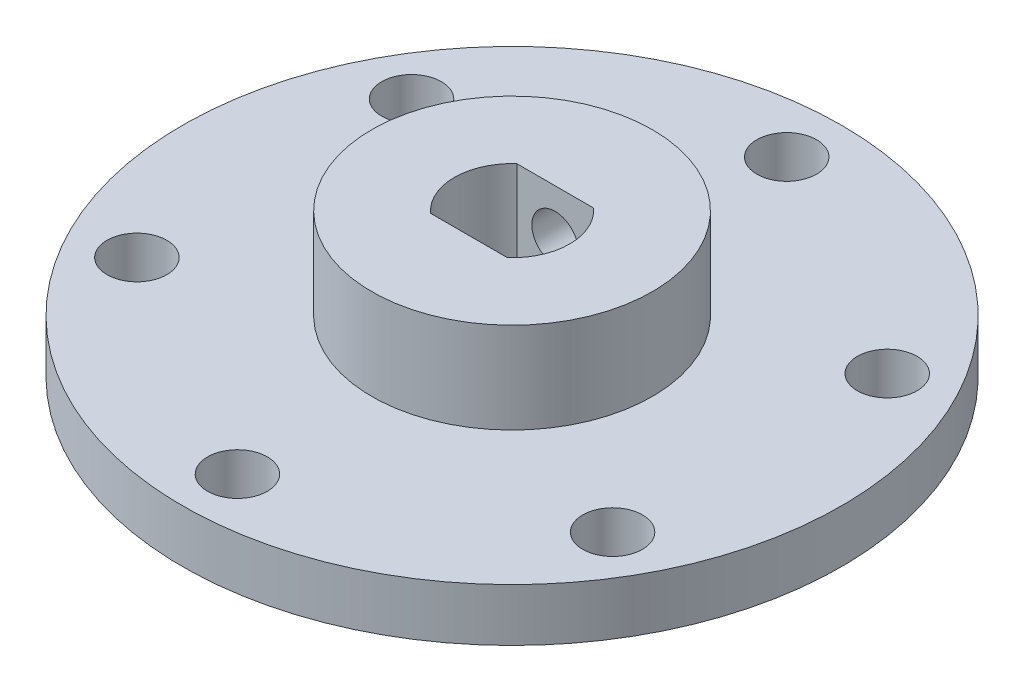
ISO-10303-21;
HEADER;
FILE_DESCRIPTION(('STEP AP214'),'2;1');
FILE_NAME('part.step','',(''),(''),'','','');
FILE_SCHEMA(('AUTOMOTIVE_DESIGN { 1 0 10303 214 1 1 1 1 }'));
ENDSEC;
DATA;
#1=APPLICATION_CONTEXT('core data for automotive mechanical design processes');
#2=APPLICATION_PROTOCOL_DEFINITION('international standard','automotive_design',2000,#1);
#3=PRODUCT_CONTEXT('',#1,'mechanical');
#4=PRODUCT('Part','Part','',(#3));
#5=PRODUCT_RELATED_PRODUCT_CATEGORY('part','',(#4));
#6=PRODUCT_DEFINITION_FORMATION('','',#4);
#7=PRODUCT_DEFINITION_CONTEXT('part definition',#1,'design');
#8=PRODUCT_DEFINITION('design','',#6,#7);
#9=PRODUCT_DEFINITION_SHAPE('','',#8);
#10=(LENGTH_UNIT() NAMED_UNIT(*) SI_UNIT(.MILLI.,.METRE.));
#11=(NAMED_UNIT(*) PLANE_ANGLE_UNIT() SI_UNIT($,.RADIAN.));
#12=(NAMED_UNIT(*) SI_UNIT($,.STERADIAN.) SOLID_ANGLE_UNIT());
#13=UNCERTAINTY_MEASURE_WITH_UNIT(LENGTH_MEASURE(1.E-05),#10,'distance_accuracy_value','');
#14=(GEOMETRIC_REPRESENTATION_CONTEXT(3) GLOBAL_UNCERTAINTY_ASSIGNED_CONTEXT((#13)) GLOBAL_UNIT_ASSIGNED_CONTEXT((#10,
#11,#12)) REPRESENTATION_CONTEXT('',''));
#15=CARTESIAN_POINT('',(0.,0.,0.));
#16=DIRECTION('',(0.,0.,1.));
#17=DIRECTION('',(1.,0.,0.));
#18=AXIS2_PLACEMENT_3D('',#15,#16,#17);
#19=CARTESIAN_POINT('',(0.,0.,0.));
#20=DIRECTION('',(0.,-1.,0.));
#21=DIRECTION('',(0.,0.,-1.));
#22=AXIS2_PLACEMENT_3D('',#19,#20,#21);
#23=CYLINDRICAL_SURFACE('',#22,12.1666);
#24=CARTESIAN_POINT('',(0.,12.446,0.));
#25=DIRECTION('',(0.,-1.,0.));
#26=DIRECTION('',(0.,0.,-1.));
#27=AXIS2_PLACEMENT_3D('',#24,#25,#26);
#28=CIRCLE('',#27,12.1666);
#29=CARTESIAN_POINT('',(0.,12.446,-12.1666));
#30=VERTEX_POINT('',#29);
#31=EDGE_CURVE('E138',#30,#30,#28,.F.);
#32=ORIENTED_EDGE('',*,*,#31,.F.);
#33=EDGE_LOOP('',(#32));
#34=FACE_BOUND('',#33,.T.);
#35=CARTESIAN_POINT('',(2.01929999999999,8.509,-11.9978574366426));
#36=CARTESIAN_POINT('',(2.01929511845313,8.62157164889014,-11.9978596126999));
#37=CARTESIAN_POINT('',(2.00985375973437,8.73421359000753,-11.999459114205));
#38=CARTESIAN_POINT('',(1.97235065563254,8.95634718508986,-12.0056792983054));
#39=CARTESIAN_POINT('',(1.94426937752031,9.06583540857096,-12.0103031500361));
#40=CARTESIAN_POINT('',(1.87035839174002,9.27840173389946,-12.0220341736068));
#41=CARTESIAN_POINT('',(1.82454404974106,9.38148529587707,-12.0291391949979));
#42=CARTESIAN_POINT('',(1.71650699324339,9.57848470137522,-12.0450291137753));
#43=CARTESIAN_POINT('',(1.65428710417711,9.67240211971511,-12.0538137218244));
#44=CARTESIAN_POINT('',(1.51456149159453,9.84933298571462,-12.0721685578173));
#45=CARTESIAN_POINT('',(1.43692792314468,9.9322448417932,-12.0817449364775));
#46=CARTESIAN_POINT('',(1.26883206435872,10.0839467548614,-12.100551999971));
#47=CARTESIAN_POINT('',(1.17836623552727,10.1527329038388,-12.1097825885623));
#48=CARTESIAN_POINT('',(0.986495216559622,10.2746168018829,-12.1269250552626));
#49=CARTESIAN_POINT('',(0.885024269316347,10.32761225752,-12.1348281961633));
#50=CARTESIAN_POINT('',(0.674537047512465,10.41571437361,-12.1483427427011));
#51=CARTESIAN_POINT('',(0.565529405501888,10.4508411276182,-12.1539567211108));
#52=CARTESIAN_POINT('',(0.379949597196918,10.4937056389582,-12.1608950308663));
#53=CARTESIAN_POINT('',(0.304570780512312,10.5066592219653,-12.1630239667755));
#54=CARTESIAN_POINT('',(0.152805424514046,10.5239579996347,-12.1658771437819));
#55=CARTESIAN_POINT('',(0.0764188983391509,10.5283033064224,-12.1666014031754));
#56=CARTESIAN_POINT('',(-0.112583680202364,10.5282951288332,-12.1665979327803));
#57=CARTESIAN_POINT('',(-0.225237622496052,10.5188518198752,-12.1650208528651));
#58=CARTESIAN_POINT('',(-0.447396162984781,10.4813402639323,-12.1588806866226));
#59=CARTESIAN_POINT('',(-0.556897340023536,10.4532525253361,-12.1543144754103));
#60=CARTESIAN_POINT('',(-0.769491071156539,10.3793226486967,-12.1427083057042));
#61=CARTESIAN_POINT('',(-0.872588976241904,10.3334955729127,-12.1356704463262));
#62=CARTESIAN_POINT('',(-1.06961250263896,10.2254285119393,-12.1198954232093));
#63=CARTESIAN_POINT('',(-1.16353971608493,10.1631913826858,-12.1111585552279));
#64=CARTESIAN_POINT('',(-1.34045989189664,10.0234482007512,-12.0928619571119));
#65=CARTESIAN_POINT('',(-1.42335427897158,9.94581816681221,-12.0832959260017));
#66=CARTESIAN_POINT('',(-1.57502236638741,9.77773675830803,-12.0644650414858));
#67=CARTESIAN_POINT('',(-1.64379210529402,9.68728179882264,-12.0552002731844));
#68=CARTESIAN_POINT('',(-1.76565857034823,9.49542063909025,-12.0379578562048));
#69=CARTESIAN_POINT('',(-1.81865006199798,9.39394680948523,-12.0299890038491));
#70=CARTESIAN_POINT('',(-1.90674402584395,9.18345336369171,-12.016342547664));
#71=CARTESIAN_POINT('',(-1.94186665041018,9.07444240619557,-12.0106623642029));
#72=CARTESIAN_POINT('',(-1.98471955542955,8.88887357431578,-12.00363823051));
#73=CARTESIAN_POINT('',(-1.99766789318473,8.8135100089549,-12.0014814164269));
#74=CARTESIAN_POINT('',(-2.01495971319943,8.66177507990063,-11.9985902907642));
#75=CARTESIAN_POINT('',(-2.01930331316447,8.58540373000726,-11.9978559597264));
#76=CARTESIAN_POINT('',(-2.01929511845313,8.39642835110986,-11.9978596126999));
#77=CARTESIAN_POINT('',(-2.00985375973437,8.28378640999247,-11.999459114205));
#78=CARTESIAN_POINT('',(-1.97235065563254,8.06165281491013,-12.0056792983054));
#79=CARTESIAN_POINT('',(-1.94426937752031,7.95216459142904,-12.0103031500361));
#80=CARTESIAN_POINT('',(-1.87035839174002,7.73959826610054,-12.0220341736068));
#81=CARTESIAN_POINT('',(-1.82454404974106,7.63651470412293,-12.0291391949979));
#82=CARTESIAN_POINT('',(-1.71650699324339,7.43951529862478,-12.0450291137753));
#83=CARTESIAN_POINT('',(-1.65428710417711,7.34559788028488,-12.0538137218244));
#84=CARTESIAN_POINT('',(-1.51456149159453,7.16866701428537,-12.0721685578173));
#85=CARTESIAN_POINT('',(-1.43692792314468,7.08575515820679,-12.0817449364775));
#86=CARTESIAN_POINT('',(-1.26883206435872,6.93405324513859,-12.100551999971));
#87=CARTESIAN_POINT('',(-1.17836623552727,6.86526709616122,-12.1097825885623));
#88=CARTESIAN_POINT('',(-0.986495216559622,6.74338319811711,-12.1269250552626));
#89=CARTESIAN_POINT('',(-0.885024269316347,6.69038774248,-12.1348281961633));
#90=CARTESIAN_POINT('',(-0.674537047512464,6.60228562638997,-12.1483427427011));
#91=CARTESIAN_POINT('',(-0.565529405501888,6.56715887238178,-12.1539567211108));
#92=CARTESIAN_POINT('',(-0.379949597196918,6.52429436104182,-12.1608950308663));
#93=CARTESIAN_POINT('',(-0.304570780512312,6.51134077803468,-12.1630239667755));
#94=CARTESIAN_POINT('',(-0.152805424514047,6.49404200036526,-12.1658771437819));
#95=CARTESIAN_POINT('',(-0.0764188983391529,6.4896966935776,-12.1666014031754));
#96=CARTESIAN_POINT('',(0.112583680202362,6.48970487116684,-12.1665979327803));
#97=CARTESIAN_POINT('',(0.22523762249605,6.49914818012476,-12.1650208528651));
#98=CARTESIAN_POINT('',(0.447396162984778,6.53665973606772,-12.1588806866226));
#99=CARTESIAN_POINT('',(0.556897340023534,6.56474747466393,-12.1543144754103));
#100=CARTESIAN_POINT('',(0.769491071156537,6.63867735130333,-12.1427083057042));
#101=CARTESIAN_POINT('',(0.872588976241902,6.68450442708731,-12.1356704463262));
#102=CARTESIAN_POINT('',(1.06961250263896,6.79257148806072,-12.1198954232093));
#103=CARTESIAN_POINT('',(1.16353971608493,6.85480861731421,-12.1111585552279));
#104=CARTESIAN_POINT('',(1.34045989189664,6.99455179924884,-12.0928619571119));
#105=CARTESIAN_POINT('',(1.42335427897158,7.07218183318778,-12.0832959260017));
#106=CARTESIAN_POINT('',(1.5750223663874,7.24026324169196,-12.0644650414858));
#107=CARTESIAN_POINT('',(1.64379210529402,7.33071820117736,-12.0552002731844));
#108=CARTESIAN_POINT('',(1.76565857034823,7.52257936090975,-12.0379578562048));
#109=CARTESIAN_POINT('',(1.81865006199798,7.62405319051477,-12.0299890038491));
#110=CARTESIAN_POINT('',(1.90674402584395,7.83454663630829,-12.016342547664));
#111=CARTESIAN_POINT('',(1.94186665041018,7.94355759380443,-12.0106623642029));
#112=CARTESIAN_POINT('',(1.98471955542955,8.12912642568422,-12.00363823051));
#113=CARTESIAN_POINT('',(1.99766789318473,8.2044899910451,-12.0014814164269));
#114=CARTESIAN_POINT('',(2.01495971319943,8.35622492009937,-11.9985902907642));
#115=CARTESIAN_POINT('',(2.01930331316447,8.43259626999274,-11.9978559597264));
#116=CARTESIAN_POINT('',(2.01929999999999,8.509,-11.9978574366426));
#117=B_SPLINE_CURVE_WITH_KNOTS('',3,(#35,#36,#37,#38,#39,#40,#41,#42,#43,#44,#45,#46,#47,#48,
#49,#50,#51,#52,#53,#54,#55,#56,#57,#58,#59,#60,#61,#62,#63,#64,#65,#66,#67,#68,#69,#70,#71,#72,
#73,#74,#75,#76,#77,#78,#79,#80,#81,#82,#83,#84,#85,#86,#87,#88,#89,#90,#91,#92,#93,#94,#95,#96,
#97,#98,#99,#100,#101,#102,#103,#104,#105,#106,#107,#108,#109,#110,#111,#112,#113,#114,#115,
#116),.UNSPECIFIED.,.T.,.F.,(4,2,2,2,2,2,2,2,2,2,2,2,2,2,2,2,2,2,2,2,2,2,2,2,2,2,2,2,2,2,2,2,2,
2,2,2,2,2,2,2,4),(0.,0.337434540123727,0.675223236528487,1.01271989249475,1.35015846128827,
1.69052247401331,2.03098052521977,2.37359839769571,2.71583013608535,2.94489952283125,
3.17396592586029,3.51143661994533,3.84926067582822,4.1867985163143,4.52427765187873,
4.8645943113057,5.20500628685547,5.5476402758644,5.88988698351416,6.11891099112123,
6.34793186585227,6.685366405976,7.02315510238076,7.36065175834702,7.69809032714054,
8.03845433986558,8.37891239107205,8.72153026354799,9.06376200193762,9.29283138868352,
9.52189779171256,9.8593684857976,10.1971925416805,10.5347303821666,10.872209517731,
11.212526177158,11.5529381527077,11.8955721417167,12.2378188493664,12.4668428569735,
12.6958637317045),.UNSPECIFIED.);
#118=CARTESIAN_POINT('',(2.01929999999999,8.509,-11.9978574366426));
#119=VERTEX_POINT('',#118);
#120=EDGE_CURVE('E21',#119,#119,#117,.T.);
#121=ORIENTED_EDGE('',*,*,#120,.T.);
#122=EDGE_LOOP('',(#121));
#123=FACE_BOUND('',#122,.T.);
#124=CARTESIAN_POINT('',(0.,4.572,0.));
#125=DIRECTION('',(0.,-1.,0.));
#126=DIRECTION('',(0.,0.,-1.));
#127=AXIS2_PLACEMENT_3D('',#124,#125,#126);
#128=CIRCLE('',#127,12.1666);
#129=CARTESIAN_POINT('',(0.,4.572,-12.1666));
#130=VERTEX_POINT('',#129);
#131=EDGE_CURVE('E136',#130,#130,#128,.T.);
#132=ORIENTED_EDGE('',*,*,#131,.F.);
#133=EDGE_LOOP('',(#132));
#134=FACE_BOUND('',#133,.T.);
#135=ADVANCED_FACE('F17',(#34,#123,#134),#23,.T.);
#136=CARTESIAN_POINT('',(0.,8.509,-3.7338));
#137=DIRECTION('',(0.,0.,1.));
#138=DIRECTION('',(1.,0.,0.));
#139=AXIS2_PLACEMENT_3D('',#136,#137,#138);
#140=CYLINDRICAL_SURFACE('',#139,2.01929999999999);
#141=ORIENTED_EDGE('',*,*,#120,.F.);
#142=EDGE_LOOP('',(#141));
#143=FACE_BOUND('',#142,.T.);
#144=CARTESIAN_POINT('',(0.,8.509,-3.7338));
#145=DIRECTION('',(0.,0.,1.));
#146=DIRECTION('',(1.,0.,0.));
#147=AXIS2_PLACEMENT_3D('',#144,#145,#146);
#148=CIRCLE('',#147,2.01929999999999);
#149=CARTESIAN_POINT('',(2.01929999999999,8.509,-3.7338));
#150=VERTEX_POINT('',#149);
#151=EDGE_CURVE('E115',#150,#150,#148,.T.);
#152=ORIENTED_EDGE('',*,*,#151,.T.);
#153=EDGE_LOOP('',(#152));
#154=FACE_BOUND('',#153,.T.);
#155=ADVANCED_FACE('F147',(#143,#154),#140,.F.);
#156=CARTESIAN_POINT('',(0.,12.446,0.));
#157=DIRECTION('',(0.,1.,0.));
#158=DIRECTION('',(0.,0.,1.));
#159=AXIS2_PLACEMENT_3D('',#156,#157,#158);
#160=PLANE('',#159);
#161=ORIENTED_EDGE('',*,*,#31,.T.);
#162=EDGE_LOOP('',(#161));
#163=FACE_BOUND('',#162,.T.);
#164=CARTESIAN_POINT('',(0.,12.446,0.));
#165=DIRECTION('',(0.,1.,0.));
#166=DIRECTION('',(0.,0.,1.));
#167=AXIS2_PLACEMENT_3D('',#164,#165,#166);
#168=CIRCLE('',#167,5.);
#169=CARTESIAN_POINT('',(3.32546802119642,12.446,-3.7338));
#170=VERTEX_POINT('',#169);
#171=CARTESIAN_POINT('',(3.32546802119642,12.446,3.7338));
#172=VERTEX_POINT('',#171);
#173=EDGE_CURVE('E74',#170,#172,#168,.F.);
#174=ORIENTED_EDGE('',*,*,#173,.T.);
#175=DIRECTION('',(1.,0.,0.));
#176=VECTOR('',#175,1.);
#177=CARTESIAN_POINT('',(-3.32546802119642,12.446,3.7338));
#178=LINE('',#177,#176);
#179=CARTESIAN_POINT('',(-3.32546802119642,12.446,3.7338));
#180=VERTEX_POINT('',#179);
#181=EDGE_CURVE('E72',#172,#180,#178,.F.);
#182=ORIENTED_EDGE('',*,*,#181,.T.);
#183=CARTESIAN_POINT('',(0.,12.446,0.));
#184=DIRECTION('',(0.,1.,0.));
#185=DIRECTION('',(0.,0.,1.));
#186=AXIS2_PLACEMENT_3D('',#183,#184,#185);
#187=CIRCLE('',#186,5.);
#188=CARTESIAN_POINT('',(-3.32546802119642,12.446,-3.7338));
#189=VERTEX_POINT('',#188);
#190=EDGE_CURVE('E58',#180,#189,#187,.F.);
#191=ORIENTED_EDGE('',*,*,#190,.T.);
#192=DIRECTION('',(-1.,0.,0.));
#193=VECTOR('',#192,1.);
#194=CARTESIAN_POINT('',(-3.32546802119642,12.446,-3.7338));
#195=LINE('',#194,#193);
#196=EDGE_CURVE('E87',#189,#170,#195,.F.);
#197=ORIENTED_EDGE('',*,*,#196,.T.);
#198=EDGE_LOOP('',(#174,#182,#191,#197));
#199=FACE_BOUND('',#198,.T.);
#200=ADVANCED_FACE('F73',(#163,#199),#160,.T.);
#201=CARTESIAN_POINT('',(28.575,4.572,0.));
#202=DIRECTION('',(0.,1.,0.));
#203=DIRECTION('',(0.,0.,1.));
#204=AXIS2_PLACEMENT_3D('',#201,#202,#203);
#205=PLANE('',#204);
#206=CARTESIAN_POINT('',(0.,4.572,0.));
#207=DIRECTION('',(0.,-1.,0.));
#208=DIRECTION('',(0.,0.,-1.));
#209=AXIS2_PLACEMENT_3D('',#206,#207,#208);
#210=CIRCLE('',#209,28.575);
#211=CARTESIAN_POINT('',(0.,4.572,-28.575));
#212=VERTEX_POINT('',#211);
#213=EDGE_CURVE('E88',#212,#212,#210,.T.);
#214=ORIENTED_EDGE('',*,*,#213,.F.);
#215=EDGE_LOOP('',(#214));
#216=FACE_BOUND('',#215,.T.);
#217=ORIENTED_EDGE('',*,*,#131,.T.);
#218=EDGE_LOOP('',(#217));
#219=FACE_BOUND('',#218,.T.);
#220=CARTESIAN_POINT('',(0.,4.572,-23.8125));
#221=DIRECTION('',(0.,1.,0.));
#222=DIRECTION('',(0.,0.,1.));
#223=AXIS2_PLACEMENT_3D('',#220,#221,#222);
#224=CIRCLE('',#223,2.5908);
#225=CARTESIAN_POINT('',(0.,4.572,-21.2217));
#226=VERTEX_POINT('',#225);
#227=EDGE_CURVE('E69',#226,#226,#224,.F.);
#228=ORIENTED_EDGE('',*,*,#227,.T.);
#229=EDGE_LOOP('',(#228));
#230=FACE_BOUND('',#229,.T.);
#231=CARTESIAN_POINT('',(20.622229927617,4.572,-11.90625));
#232=DIRECTION('',(0.,1.,0.));
#233=DIRECTION('',(0.,0.,1.));
#234=AXIS2_PLACEMENT_3D('',#231,#232,#233);
#235=CIRCLE('',#234,2.5908);
#236=CARTESIAN_POINT('',(20.622229927617,4.572,-9.31544999999995));
#237=VERTEX_POINT('',#236);
#238=EDGE_CURVE('E121',#237,#237,#235,.F.);
#239=ORIENTED_EDGE('',*,*,#238,.T.);
#240=EDGE_LOOP('',(#239));
#241=FACE_BOUND('',#240,.T.);
#242=CARTESIAN_POINT('',(20.6222299276169,4.572,11.9062500000001));
#243=DIRECTION('',(0.,1.,0.));
#244=DIRECTION('',(0.,0.,1.));
#245=AXIS2_PLACEMENT_3D('',#242,#243,#244);
#246=CIRCLE('',#245,2.5908);
#247=CARTESIAN_POINT('',(20.6222299276169,4.572,14.4970500000001));
#248=VERTEX_POINT('',#247);
#249=EDGE_CURVE('E124',#248,#248,#246,.F.);
#250=ORIENTED_EDGE('',*,*,#249,.T.);
#251=EDGE_LOOP('',(#250));
#252=FACE_BOUND('',#251,.T.);
#253=CARTESIAN_POINT('',(0.,4.572,23.8125));
#254=DIRECTION('',(0.,1.,0.));
#255=DIRECTION('',(0.,0.,1.));
#256=AXIS2_PLACEMENT_3D('',#253,#254,#255);
#257=CIRCLE('',#256,2.5908);
#258=CARTESIAN_POINT('',(0.,4.572,26.4033));
#259=VERTEX_POINT('',#258);
#260=EDGE_CURVE('E127',#259,#259,#257,.F.);
#261=ORIENTED_EDGE('',*,*,#260,.T.);
#262=EDGE_LOOP('',(#261));
#263=FACE_BOUND('',#262,.T.);
#264=CARTESIAN_POINT('',(-20.6222299276171,4.572,11.9062499999998));
#265=DIRECTION('',(0.,1.,0.));
#266=DIRECTION('',(0.,0.,1.));
#267=AXIS2_PLACEMENT_3D('',#264,#265,#266);
#268=CIRCLE('',#267,2.5908);
#269=CARTESIAN_POINT('',(-20.6222299276171,4.572,14.4970499999998));
#270=VERTEX_POINT('',#269);
#271=EDGE_CURVE('E130',#270,#270,#268,.F.);
#272=ORIENTED_EDGE('',*,*,#271,.T.);
#273=EDGE_LOOP('',(#272));
#274=FACE_BOUND('',#273,.T.);
#275=CARTESIAN_POINT('',(-20.6222299276168,4.572,-11.9062500000002));
#276=DIRECTION('',(0.,1.,0.));
#277=DIRECTION('',(0.,0.,1.));
#278=AXIS2_PLACEMENT_3D('',#275,#276,#277);
#279=CIRCLE('',#278,2.5908);
#280=CARTESIAN_POINT('',(-20.6222299276168,4.572,-9.31545000000024));
#281=VERTEX_POINT('',#280);
#282=EDGE_CURVE('E133',#281,#281,#279,.F.);
#283=ORIENTED_EDGE('',*,*,#282,.T.);
#284=EDGE_LOOP('',(#283));
#285=FACE_BOUND('',#284,.T.);
#286=ADVANCED_FACE('F191',(#216,#219,#230,#241,#252,#263,#274,#285),#205,.T.);
#287=CARTESIAN_POINT('',(-20.6222299276168,0.,-11.9062500000002));
#288=DIRECTION('',(0.,1.,0.));
#289=DIRECTION('',(0.,0.,1.));
#290=AXIS2_PLACEMENT_3D('',#287,#288,#289);
#291=CYLINDRICAL_SURFACE('',#290,2.5908);
#292=ORIENTED_EDGE('',*,*,#282,.F.);
#293=EDGE_LOOP('',(#292));
#294=FACE_BOUND('',#293,.T.);
#295=CARTESIAN_POINT('',(-20.6222299276168,0.,-11.9062500000002));
#296=DIRECTION('',(0.,1.,0.));
#297=DIRECTION('',(0.,0.,1.));
#298=AXIS2_PLACEMENT_3D('',#295,#296,#297);
#299=CIRCLE('',#298,2.5908);
#300=CARTESIAN_POINT('',(-20.6222299276168,0.,-9.31545000000024));
#301=VERTEX_POINT('',#300);
#302=EDGE_CURVE('E110',#301,#301,#299,.T.);
#303=ORIENTED_EDGE('',*,*,#302,.F.);
#304=EDGE_LOOP('',(#303));
#305=FACE_BOUND('',#304,.T.);
#306=ADVANCED_FACE('F188',(#294,#305),#291,.F.);
#307=CARTESIAN_POINT('',(-20.6222299276171,0.,11.9062499999998));
#308=DIRECTION('',(0.,1.,0.));
#309=DIRECTION('',(0.,0.,1.));
#310=AXIS2_PLACEMENT_3D('',#307,#308,#309);
#311=CYLINDRICAL_SURFACE('',#310,2.5908);
#312=ORIENTED_EDGE('',*,*,#271,.F.);
#313=EDGE_LOOP('',(#312));
#314=FACE_BOUND('',#313,.T.);
#315=CARTESIAN_POINT('',(-20.6222299276171,0.,11.9062499999998));
#316=DIRECTION('',(0.,1.,0.));
#317=DIRECTION('',(0.,0.,1.));
#318=AXIS2_PLACEMENT_3D('',#315,#316,#317);
#319=CIRCLE('',#318,2.5908);
#320=CARTESIAN_POINT('',(-20.6222299276171,0.,14.4970499999998));
#321=VERTEX_POINT('',#320);
#322=EDGE_CURVE('E107',#321,#321,#319,.T.);
#323=ORIENTED_EDGE('',*,*,#322,.F.);
#324=EDGE_LOOP('',(#323));
#325=FACE_BOUND('',#324,.T.);
#326=ADVANCED_FACE('F190',(#314,#325),#311,.F.);
#327=CARTESIAN_POINT('',(0.,0.,23.8125));
#328=DIRECTION('',(0.,1.,0.));
#329=DIRECTION('',(0.,0.,1.));
#330=AXIS2_PLACEMENT_3D('',#327,#328,#329);
#331=CYLINDRICAL_SURFACE('',#330,2.5908);
#332=ORIENTED_EDGE('',*,*,#260,.F.);
#333=EDGE_LOOP('',(#332));
#334=FACE_BOUND('',#333,.T.);
#335=CARTESIAN_POINT('',(0.,0.,23.8125));
#336=DIRECTION('',(0.,1.,0.));
#337=DIRECTION('',(0.,0.,1.));
#338=AXIS2_PLACEMENT_3D('',#335,#336,#337);
#339=CIRCLE('',#338,2.5908);
#340=CARTESIAN_POINT('',(0.,0.,26.4033));
#341=VERTEX_POINT('',#340);
#342=EDGE_CURVE('E104',#341,#341,#339,.T.);
#343=ORIENTED_EDGE('',*,*,#342,.F.);
#344=EDGE_LOOP('',(#343));
#345=FACE_BOUND('',#344,.T.);
#346=ADVANCED_FACE('F198',(#334,#345),#331,.F.);
#347=CARTESIAN_POINT('',(20.6222299276169,0.,11.9062500000001));
#348=DIRECTION('',(0.,1.,0.));
#349=DIRECTION('',(0.,0.,1.));
#350=AXIS2_PLACEMENT_3D('',#347,#348,#349);
#351=CYLINDRICAL_SURFACE('',#350,2.5908);
#352=ORIENTED_EDGE('',*,*,#249,.F.);
#353=EDGE_LOOP('',(#352));
#354=FACE_BOUND('',#353,.T.);
#355=CARTESIAN_POINT('',(20.6222299276169,0.,11.9062500000001));
#356=DIRECTION('',(0.,1.,0.));
#357=DIRECTION('',(0.,0.,1.));
#358=AXIS2_PLACEMENT_3D('',#355,#356,#357);
#359=CIRCLE('',#358,2.5908);
#360=CARTESIAN_POINT('',(20.6222299276169,0.,14.4970500000001));
#361=VERTEX_POINT('',#360);
#362=EDGE_CURVE('E101',#361,#361,#359,.T.);
#363=ORIENTED_EDGE('',*,*,#362,.F.);
#364=EDGE_LOOP('',(#363));
#365=FACE_BOUND('',#364,.T.);
#366=ADVANCED_FACE('F241',(#354,#365),#351,.F.);
#367=CARTESIAN_POINT('',(20.622229927617,0.,-11.90625));
#368=DIRECTION('',(0.,1.,0.));
#369=DIRECTION('',(0.,0.,1.));
#370=AXIS2_PLACEMENT_3D('',#367,#368,#369);
#371=CYLINDRICAL_SURFACE('',#370,2.5908);
#372=ORIENTED_EDGE('',*,*,#238,.F.);
#373=EDGE_LOOP('',(#372));
#374=FACE_BOUND('',#373,.T.);
#375=CARTESIAN_POINT('',(20.622229927617,0.,-11.90625));
#376=DIRECTION('',(0.,1.,0.));
#377=DIRECTION('',(0.,0.,1.));
#378=AXIS2_PLACEMENT_3D('',#375,#376,#377);
#379=CIRCLE('',#378,2.5908);
#380=CARTESIAN_POINT('',(20.622229927617,0.,-9.31544999999995));
#381=VERTEX_POINT('',#380);
#382=EDGE_CURVE('E98',#381,#381,#379,.T.);
#383=ORIENTED_EDGE('',*,*,#382,.F.);
#384=EDGE_LOOP('',(#383));
#385=FACE_BOUND('',#384,.T.);
#386=ADVANCED_FACE('F250',(#374,#385),#371,.F.);
#387=CARTESIAN_POINT('',(0.,0.,-23.8125));
#388=DIRECTION('',(0.,1.,0.));
#389=DIRECTION('',(0.,0.,1.));
#390=AXIS2_PLACEMENT_3D('',#387,#388,#389);
#391=CYLINDRICAL_SURFACE('',#390,2.5908);
#392=ORIENTED_EDGE('',*,*,#227,.F.);
#393=EDGE_LOOP('',(#392));
#394=FACE_BOUND('',#393,.T.);
#395=CARTESIAN_POINT('',(0.,0.,-23.8125));
#396=DIRECTION('',(0.,1.,0.));
#397=DIRECTION('',(0.,0.,1.));
#398=AXIS2_PLACEMENT_3D('',#395,#396,#397);
#399=CIRCLE('',#398,2.5908);
#400=CARTESIAN_POINT('',(0.,0.,-21.2217));
#401=VERTEX_POINT('',#400);
#402=EDGE_CURVE('E95',#401,#401,#399,.T.);
#403=ORIENTED_EDGE('',*,*,#402,.F.);
#404=EDGE_LOOP('',(#403));
#405=FACE_BOUND('',#404,.T.);
#406=ADVANCED_FACE('F260',(#394,#405),#391,.F.);
#407=CARTESIAN_POINT('',(0.,0.,0.));
#408=DIRECTION('',(0.,1.,0.));
#409=DIRECTION('',(0.,0.,1.));
#410=AXIS2_PLACEMENT_3D('',#407,#408,#409);
#411=CYLINDRICAL_SURFACE('',#410,5.);
#412=DIRECTION('',(0.,1.,0.));
#413=VECTOR('',#412,1.);
#414=CARTESIAN_POINT('',(-3.32546802119642,0.,3.7338));
#415=LINE('',#414,#413);
#416=CARTESIAN_POINT('',(-3.32546802119642,0.,3.7338));
#417=VERTEX_POINT('',#416);
#418=EDGE_CURVE('E62',#180,#417,#415,.F.);
#419=ORIENTED_EDGE('',*,*,#418,.T.);
#420=CARTESIAN_POINT('',(0.,0.,0.));
#421=DIRECTION('',(0.,1.,0.));
#422=DIRECTION('',(0.,0.,1.));
#423=AXIS2_PLACEMENT_3D('',#420,#421,#422);
#424=CIRCLE('',#423,5.);
#425=CARTESIAN_POINT('',(-3.32546802119642,0.,-3.7338));
#426=VERTEX_POINT('',#425);
#427=EDGE_CURVE('E93',#426,#417,#424,.T.);
#428=ORIENTED_EDGE('',*,*,#427,.F.);
#429=DIRECTION('',(0.,1.,0.));
#430=VECTOR('',#429,1.);
#431=CARTESIAN_POINT('',(-3.32546802119642,0.,-3.7338));
#432=LINE('',#431,#430);
#433=EDGE_CURVE('E65',#426,#189,#432,.T.);
#434=ORIENTED_EDGE('',*,*,#433,.T.);
#435=ORIENTED_EDGE('',*,*,#190,.F.);
#436=EDGE_LOOP('',(#419,#428,#434,#435));
#437=FACE_BOUND('',#436,.T.);
#438=ADVANCED_FACE('F60',(#437),#411,.F.);
#439=CARTESIAN_POINT('',(-3.32546802119642,0.,3.7338));
#440=DIRECTION('',(0.,0.,1.));
#441=DIRECTION('',(1.,0.,0.));
#442=AXIS2_PLACEMENT_3D('',#439,#440,#441);
#443=PLANE('',#442);
#444=DIRECTION('',(0.,1.,0.));
#445=VECTOR('',#444,1.);
#446=CARTESIAN_POINT('',(3.32546802119642,0.,3.7338));
#447=LINE('',#446,#445);
#448=CARTESIAN_POINT('',(3.32546802119642,0.,3.7338));
#449=VERTEX_POINT('',#448);
#450=EDGE_CURVE('E77',#172,#449,#447,.F.);
#451=ORIENTED_EDGE('',*,*,#450,.T.);
#452=DIRECTION('',(1.,0.,0.));
#453=VECTOR('',#452,1.);
#454=CARTESIAN_POINT('',(0.,0.,3.7338));
#455=LINE('',#454,#453);
#456=EDGE_CURVE('E81',#417,#449,#455,.T.);
#457=ORIENTED_EDGE('',*,*,#456,.F.);
#458=ORIENTED_EDGE('',*,*,#418,.F.);
#459=ORIENTED_EDGE('',*,*,#181,.F.);
#460=EDGE_LOOP('',(#451,#457,#458,#459));
#461=FACE_BOUND('',#460,.T.);
#462=ADVANCED_FACE('F79',(#461),#443,.F.);
#463=CARTESIAN_POINT('',(0.,0.,0.));
#464=DIRECTION('',(0.,1.,0.));
#465=DIRECTION('',(0.,0.,1.));
#466=AXIS2_PLACEMENT_3D('',#463,#464,#465);
#467=CYLINDRICAL_SURFACE('',#466,5.);
#468=DIRECTION('',(0.,1.,0.));
#469=VECTOR('',#468,1.);
#470=CARTESIAN_POINT('',(3.32546802119642,0.,-3.7338));
#471=LINE('',#470,#469);
#472=CARTESIAN_POINT('',(3.32546802119642,0.,-3.7338));
#473=VERTEX_POINT('',#472);
#474=EDGE_CURVE('E38',#170,#473,#471,.F.);
#475=ORIENTED_EDGE('',*,*,#474,.T.);
#476=CARTESIAN_POINT('',(0.,0.,0.));
#477=DIRECTION('',(0.,1.,0.));
#478=DIRECTION('',(0.,0.,1.));
#479=AXIS2_PLACEMENT_3D('',#476,#477,#478);
#480=CIRCLE('',#479,5.);
#481=EDGE_CURVE('E90',#449,#473,#480,.T.);
#482=ORIENTED_EDGE('',*,*,#481,.F.);
#483=ORIENTED_EDGE('',*,*,#450,.F.);
#484=ORIENTED_EDGE('',*,*,#173,.F.);
#485=EDGE_LOOP('',(#475,#482,#483,#484));
#486=FACE_BOUND('',#485,.T.);
#487=ADVANCED_FACE('F155',(#486),#467,.F.);
#488=CARTESIAN_POINT('',(-3.32546802119642,0.,-3.7338));
#489=DIRECTION('',(0.,0.,-1.));
#490=DIRECTION('',(-1.,0.,0.));
#491=AXIS2_PLACEMENT_3D('',#488,#489,#490);
#492=PLANE('',#491);
#493=ORIENTED_EDGE('',*,*,#433,.F.);
#494=DIRECTION('',(1.,0.,0.));
#495=VECTOR('',#494,1.);
#496=CARTESIAN_POINT('',(0.,0.,-3.7338));
#497=LINE('',#496,#495);
#498=EDGE_CURVE('E29',#473,#426,#497,.F.);
#499=ORIENTED_EDGE('',*,*,#498,.F.);
#500=ORIENTED_EDGE('',*,*,#474,.F.);
#501=ORIENTED_EDGE('',*,*,#196,.F.);
#502=EDGE_LOOP('',(#493,#499,#500,#501));
#503=FACE_BOUND('',#502,.T.);
#504=ORIENTED_EDGE('',*,*,#151,.F.);
#505=EDGE_LOOP('',(#504));
#506=FACE_BOUND('',#505,.T.);
#507=ADVANCED_FACE('F152',(#503,#506),#492,.F.);
#508=CARTESIAN_POINT('',(0.,0.,0.));
#509=DIRECTION('',(0.,-1.,0.));
#510=DIRECTION('',(0.,0.,-1.));
#511=AXIS2_PLACEMENT_3D('',#508,#509,#510);
#512=CYLINDRICAL_SURFACE('',#511,28.575);
#513=ORIENTED_EDGE('',*,*,#213,.T.);
#514=EDGE_LOOP('',(#513));
#515=FACE_BOUND('',#514,.T.);
#516=CARTESIAN_POINT('',(0.,0.,0.));
#517=DIRECTION('',(0.,-1.,0.));
#518=DIRECTION('',(0.,0.,-1.));
#519=AXIS2_PLACEMENT_3D('',#516,#517,#518);
#520=CIRCLE('',#519,28.575);
#521=CARTESIAN_POINT('',(0.,0.,-28.575));
#522=VERTEX_POINT('',#521);
#523=EDGE_CURVE('E10',#522,#522,#520,.T.);
#524=ORIENTED_EDGE('',*,*,#523,.F.);
#525=EDGE_LOOP('',(#524));
#526=FACE_BOUND('',#525,.T.);
#527=ADVANCED_FACE('F154',(#515,#526),#512,.T.);
#528=CARTESIAN_POINT('',(0.,0.,0.));
#529=DIRECTION('',(0.,-1.,0.));
#530=DIRECTION('',(0.,0.,-1.));
#531=AXIS2_PLACEMENT_3D('',#528,#529,#530);
#532=PLANE('',#531);
#533=ORIENTED_EDGE('',*,*,#523,.T.);
#534=EDGE_LOOP('',(#533));
#535=FACE_BOUND('',#534,.T.);
#536=ORIENTED_EDGE('',*,*,#481,.T.);
#537=ORIENTED_EDGE('',*,*,#498,.T.);
#538=ORIENTED_EDGE('',*,*,#427,.T.);
#539=ORIENTED_EDGE('',*,*,#456,.T.);
#540=EDGE_LOOP('',(#536,#537,#538,#539));
#541=FACE_BOUND('',#540,.T.);
#542=ORIENTED_EDGE('',*,*,#402,.T.);
#543=EDGE_LOOP('',(#542));
#544=FACE_BOUND('',#543,.T.);
#545=ORIENTED_EDGE('',*,*,#382,.T.);
#546=EDGE_LOOP('',(#545));
#547=FACE_BOUND('',#546,.T.);
#548=ORIENTED_EDGE('',*,*,#362,.T.);
#549=EDGE_LOOP('',(#548));
#550=FACE_BOUND('',#549,.T.);
#551=ORIENTED_EDGE('',*,*,#342,.T.);
#552=EDGE_LOOP('',(#551));
#553=FACE_BOUND('',#552,.T.);
#554=ORIENTED_EDGE('',*,*,#322,.T.);
#555=EDGE_LOOP('',(#554));
#556=FACE_BOUND('',#555,.T.);
#557=ORIENTED_EDGE('',*,*,#302,.T.);
#558=EDGE_LOOP('',(#557));
#559=FACE_BOUND('',#558,.T.);
#560=ADVANCED_FACE('F163',(#535,#541,#544,#547,#550,#553,#556,#559),#532,.T.);
#561=CLOSED_SHELL('',(#135,#155,#200,#286,#306,#326,#346,#366,#386,#406,#438,#462,#487,#507,
#527,#560));
#562=MANIFOLD_SOLID_BREP('B1',#561);
#563=ADVANCED_BREP_SHAPE_REPRESENTATION('',(#18,#562),#14);
#564=SHAPE_DEFINITION_REPRESENTATION(#9,#563);
ENDSEC;
END-ISO-10303-21;
